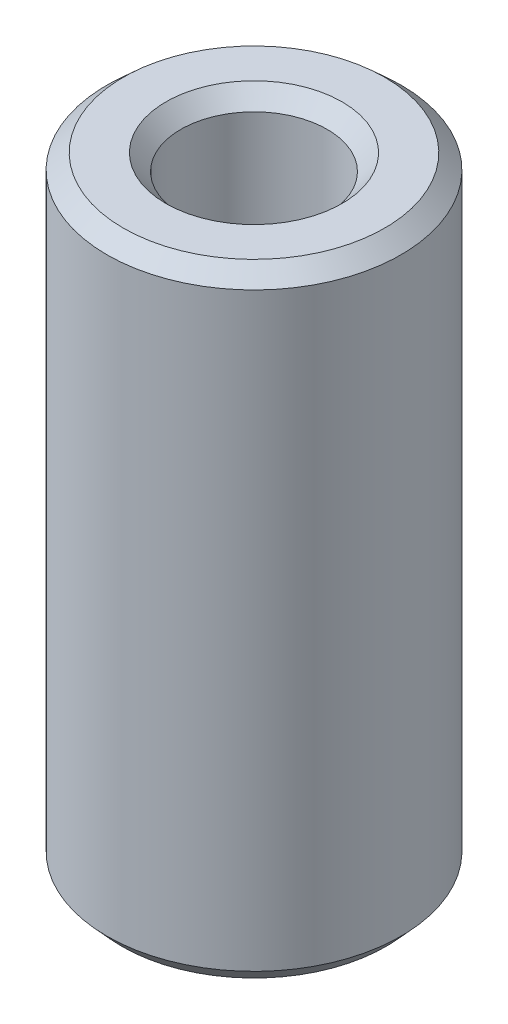
ISO-10303-21;
HEADER;
FILE_DESCRIPTION(('STEP AP214'),'2;1');
FILE_NAME('part.step','',(''),(''),'','','');
FILE_SCHEMA(('AUTOMOTIVE_DESIGN { 1 0 10303 214 1 1 1 1 }'));
ENDSEC;
DATA;
#1=APPLICATION_CONTEXT('core data for automotive mechanical design processes');
#2=APPLICATION_PROTOCOL_DEFINITION('international standard','automotive_design',2000,#1);
#3=PRODUCT_CONTEXT('',#1,'mechanical');
#4=PRODUCT('Part','Part','',(#3));
#5=PRODUCT_RELATED_PRODUCT_CATEGORY('part','',(#4));
#6=PRODUCT_DEFINITION_FORMATION('','',#4);
#7=PRODUCT_DEFINITION_CONTEXT('part definition',#1,'design');
#8=PRODUCT_DEFINITION('design','',#6,#7);
#9=PRODUCT_DEFINITION_SHAPE('','',#8);
#10=(LENGTH_UNIT() NAMED_UNIT(*) SI_UNIT(.MILLI.,.METRE.));
#11=(NAMED_UNIT(*) PLANE_ANGLE_UNIT() SI_UNIT($,.RADIAN.));
#12=(NAMED_UNIT(*) SI_UNIT($,.STERADIAN.) SOLID_ANGLE_UNIT());
#13=UNCERTAINTY_MEASURE_WITH_UNIT(LENGTH_MEASURE(1.E-05),#10,'distance_accuracy_value','');
#14=(GEOMETRIC_REPRESENTATION_CONTEXT(3) GLOBAL_UNCERTAINTY_ASSIGNED_CONTEXT((#13)) GLOBAL_UNIT_ASSIGNED_CONTEXT((#10,
#11,#12)) REPRESENTATION_CONTEXT('',''));
#15=CARTESIAN_POINT('',(0.,0.,0.));
#16=DIRECTION('',(0.,0.,1.));
#17=DIRECTION('',(1.,0.,0.));
#18=AXIS2_PLACEMENT_3D('',#15,#16,#17);
#19=CARTESIAN_POINT('',(0.,21.1305089454916,0.));
#20=DIRECTION('',(0.,-1.,0.));
#21=DIRECTION('',(0.,0.,-1.));
#22=AXIS2_PLACEMENT_3D('',#19,#20,#21);
#23=CYLINDRICAL_SURFACE('',#22,5.);
#24=CARTESIAN_POINT('',(0.,0.555717584230883,0.));
#25=DIRECTION('',(0.,1.,0.));
#26=DIRECTION('',(0.,0.,1.));
#27=AXIS2_PLACEMENT_3D('',#24,#25,#26);
#28=CIRCLE('',#27,5.);
#29=CARTESIAN_POINT('',(0.,0.555717584230883,5.));
#30=VERTEX_POINT('',#29);
#31=EDGE_CURVE('E10',#30,#30,#28,.T.);
#32=ORIENTED_EDGE('',*,*,#31,.T.);
#33=EDGE_LOOP('',(#32));
#34=FACE_BOUND('',#33,.T.);
#35=CARTESIAN_POINT('',(0.,20.6228436259364,0.));
#36=DIRECTION('',(0.,1.,0.));
#37=DIRECTION('',(0.,0.,1.));
#38=AXIS2_PLACEMENT_3D('',#35,#36,#37);
#39=CIRCLE('',#38,5.);
#40=CARTESIAN_POINT('',(0.,20.6228436259364,5.));
#41=VERTEX_POINT('',#40);
#42=EDGE_CURVE('E50',#41,#41,#39,.F.);
#43=ORIENTED_EDGE('',*,*,#42,.T.);
#44=EDGE_LOOP('',(#43));
#45=FACE_BOUND('',#44,.T.);
#46=ADVANCED_FACE('F39',(#34,#45),#23,.T.);
#47=CARTESIAN_POINT('',(0.,21.1305089454916,0.));
#48=DIRECTION('',(0.,1.,0.));
#49=DIRECTION('',(0.,0.,1.));
#50=AXIS2_PLACEMENT_3D('',#47,#48,#49);
#51=PLANE('',#50);
#52=CARTESIAN_POINT('',(0.,21.1305089454916,0.));
#53=DIRECTION('',(0.,1.,0.));
#54=DIRECTION('',(0.,0.,1.));
#55=AXIS2_PLACEMENT_3D('',#52,#53,#54);
#56=CIRCLE('',#55,2.99632821129183);
#57=CARTESIAN_POINT('',(0.,21.1305089454916,2.99632821129183));
#58=VERTEX_POINT('',#57);
#59=EDGE_CURVE('E58',#58,#58,#56,.F.);
#60=ORIENTED_EDGE('',*,*,#59,.T.);
#61=EDGE_LOOP('',(#60));
#62=FACE_BOUND('',#61,.T.);
#63=CARTESIAN_POINT('',(0.,21.1305089454916,0.));
#64=DIRECTION('',(0.,1.,0.));
#65=DIRECTION('',(0.,0.,1.));
#66=AXIS2_PLACEMENT_3D('',#63,#64,#65);
#67=CIRCLE('',#66,4.44428241576912);
#68=CARTESIAN_POINT('',(0.,21.1305089454916,4.44428241576912));
#69=VERTEX_POINT('',#68);
#70=EDGE_CURVE('E61',#69,#69,#67,.T.);
#71=ORIENTED_EDGE('',*,*,#70,.T.);
#72=EDGE_LOOP('',(#71));
#73=FACE_BOUND('',#72,.T.);
#74=ADVANCED_FACE('F88',(#62,#73),#51,.T.);
#75=CARTESIAN_POINT('',(0.,0.,0.));
#76=DIRECTION('',(0.,1.,0.));
#77=DIRECTION('',(0.,0.,1.));
#78=AXIS2_PLACEMENT_3D('',#75,#76,#77);
#79=PLANE('',#78);
#80=CARTESIAN_POINT('',(0.,0.,0.));
#81=DIRECTION('',(0.,1.,0.));
#82=DIRECTION('',(0.,0.,1.));
#83=AXIS2_PLACEMENT_3D('',#80,#81,#82);
#84=CIRCLE('',#83,3.04438047596747);
#85=CARTESIAN_POINT('',(0.,0.,3.04438047596747));
#86=VERTEX_POINT('',#85);
#87=EDGE_CURVE('E51',#86,#86,#84,.T.);
#88=ORIENTED_EDGE('',*,*,#87,.T.);
#89=EDGE_LOOP('',(#88));
#90=FACE_BOUND('',#89,.T.);
#91=CARTESIAN_POINT('',(0.,0.,0.));
#92=DIRECTION('',(0.,1.,0.));
#93=DIRECTION('',(0.,0.,1.));
#94=AXIS2_PLACEMENT_3D('',#91,#92,#93);
#95=CIRCLE('',#94,4.49233468044475);
#96=CARTESIAN_POINT('',(0.,0.,4.49233468044475));
#97=VERTEX_POINT('',#96);
#98=EDGE_CURVE('E54',#97,#97,#95,.F.);
#99=ORIENTED_EDGE('',*,*,#98,.T.);
#100=EDGE_LOOP('',(#99));
#101=FACE_BOUND('',#100,.T.);
#102=ADVANCED_FACE('F83',(#90,#101),#79,.F.);
#103=CARTESIAN_POINT('',(0.,21.1305089454916,0.));
#104=DIRECTION('',(0.,-1.,0.));
#105=DIRECTION('',(0.,0.,-1.));
#106=AXIS2_PLACEMENT_3D('',#103,#104,#105);
#107=CYLINDRICAL_SURFACE('',#106,2.48866289173659);
#108=CARTESIAN_POINT('',(0.,20.5747913612608,0.));
#109=DIRECTION('',(0.,1.,0.));
#110=DIRECTION('',(0.,0.,1.));
#111=AXIS2_PLACEMENT_3D('',#108,#109,#110);
#112=CIRCLE('',#111,2.48866289173659);
#113=CARTESIAN_POINT('',(0.,20.5747913612608,2.48866289173659));
#114=VERTEX_POINT('',#113);
#115=EDGE_CURVE('E67',#114,#114,#112,.T.);
#116=ORIENTED_EDGE('',*,*,#115,.T.);
#117=EDGE_LOOP('',(#116));
#118=FACE_BOUND('',#117,.T.);
#119=CARTESIAN_POINT('',(0.,0.507665319555241,0.));
#120=DIRECTION('',(0.,1.,0.));
#121=DIRECTION('',(0.,0.,1.));
#122=AXIS2_PLACEMENT_3D('',#119,#120,#121);
#123=CIRCLE('',#122,2.48866289173659);
#124=CARTESIAN_POINT('',(0.,0.507665319555241,2.48866289173659));
#125=VERTEX_POINT('',#124);
#126=EDGE_CURVE('E69',#125,#125,#123,.F.);
#127=ORIENTED_EDGE('',*,*,#126,.T.);
#128=EDGE_LOOP('',(#127));
#129=FACE_BOUND('',#128,.T.);
#130=ADVANCED_FACE('F71',(#118,#129),#107,.F.);
#131=CARTESIAN_POINT('',(0.,20.5747913612608,0.));
#132=DIRECTION('',(0.,1.,0.));
#133=DIRECTION('',(0.,0.,1.));
#134=AXIS2_PLACEMENT_3D('',#131,#132,#133);
#135=CONICAL_SURFACE('',#134,2.48866289173659,0.740240772303364);
#136=ORIENTED_EDGE('',*,*,#59,.F.);
#137=EDGE_LOOP('',(#136));
#138=FACE_BOUND('',#137,.T.);
#139=ORIENTED_EDGE('',*,*,#115,.F.);
#140=EDGE_LOOP('',(#139));
#141=FACE_BOUND('',#140,.T.);
#142=ADVANCED_FACE('F77',(#138,#141),#135,.F.);
#143=CARTESIAN_POINT('',(0.,0.,0.));
#144=DIRECTION('',(0.,-1.,0.));
#145=DIRECTION('',(0.,0.,-1.));
#146=AXIS2_PLACEMENT_3D('',#143,#144,#145);
#147=CONICAL_SURFACE('',#146,3.04438047596747,0.83055555449154);
#148=ORIENTED_EDGE('',*,*,#126,.F.);
#149=EDGE_LOOP('',(#148));
#150=FACE_BOUND('',#149,.T.);
#151=ORIENTED_EDGE('',*,*,#87,.F.);
#152=EDGE_LOOP('',(#151));
#153=FACE_BOUND('',#152,.T.);
#154=ADVANCED_FACE('F73',(#150,#153),#147,.F.);
#155=CARTESIAN_POINT('',(0.,0.555717584230883,0.));
#156=DIRECTION('',(0.,1.,0.));
#157=DIRECTION('',(0.,0.,1.));
#158=AXIS2_PLACEMENT_3D('',#155,#156,#157);
#159=CONICAL_SURFACE('',#158,5.,0.740240772303363);
#160=ORIENTED_EDGE('',*,*,#98,.F.);
#161=EDGE_LOOP('',(#160));
#162=FACE_BOUND('',#161,.T.);
#163=ORIENTED_EDGE('',*,*,#31,.F.);
#164=EDGE_LOOP('',(#163));
#165=FACE_BOUND('',#164,.T.);
#166=ADVANCED_FACE('F76',(#162,#165),#159,.T.);
#167=CARTESIAN_POINT('',(0.,21.1305089454916,0.));
#168=DIRECTION('',(0.,-1.,0.));
#169=DIRECTION('',(0.,0.,-1.));
#170=AXIS2_PLACEMENT_3D('',#167,#168,#169);
#171=CONICAL_SURFACE('',#170,4.44428241576912,0.830555554491539);
#172=ORIENTED_EDGE('',*,*,#42,.F.);
#173=EDGE_LOOP('',(#172));
#174=FACE_BOUND('',#173,.T.);
#175=ORIENTED_EDGE('',*,*,#70,.F.);
#176=EDGE_LOOP('',(#175));
#177=FACE_BOUND('',#176,.T.);
#178=ADVANCED_FACE('F45',(#174,#177),#171,.T.);
#179=CLOSED_SHELL('',(#46,#74,#102,#130,#142,#154,#166,#178));
#180=MANIFOLD_SOLID_BREP('B2',#179);
#181=ADVANCED_BREP_SHAPE_REPRESENTATION('',(#18,#180),#14);
#182=SHAPE_DEFINITION_REPRESENTATION(#9,#181);
ENDSEC;
END-ISO-10303-21;
